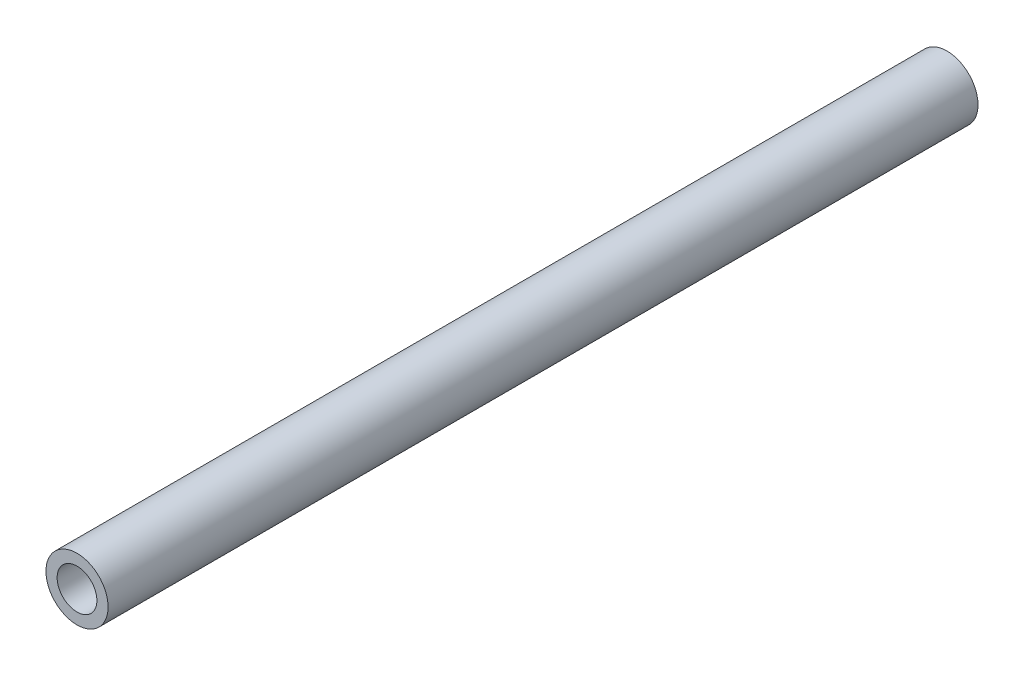
ISO-10303-21;
HEADER;
FILE_DESCRIPTION(('STEP AP214'),'2;1');
FILE_NAME('part.step','',(''),(''),'','','');
FILE_SCHEMA(('AUTOMOTIVE_DESIGN { 1 0 10303 214 1 1 1 1 }'));
ENDSEC;
DATA;
#1=APPLICATION_CONTEXT('core data for automotive mechanical design processes');
#2=APPLICATION_PROTOCOL_DEFINITION('international standard','automotive_design',2000,#1);
#3=PRODUCT_CONTEXT('',#1,'mechanical');
#4=PRODUCT('Part','Part','',(#3));
#5=PRODUCT_RELATED_PRODUCT_CATEGORY('part','',(#4));
#6=PRODUCT_DEFINITION_FORMATION('','',#4);
#7=PRODUCT_DEFINITION_CONTEXT('part definition',#1,'design');
#8=PRODUCT_DEFINITION('design','',#6,#7);
#9=PRODUCT_DEFINITION_SHAPE('','',#8);
#10=(LENGTH_UNIT() NAMED_UNIT(*) SI_UNIT(.MILLI.,.METRE.));
#11=(NAMED_UNIT(*) PLANE_ANGLE_UNIT() SI_UNIT($,.RADIAN.));
#12=(NAMED_UNIT(*) SI_UNIT($,.STERADIAN.) SOLID_ANGLE_UNIT());
#13=UNCERTAINTY_MEASURE_WITH_UNIT(LENGTH_MEASURE(1.E-05),#10,'distance_accuracy_value','');
#14=(GEOMETRIC_REPRESENTATION_CONTEXT(3) GLOBAL_UNCERTAINTY_ASSIGNED_CONTEXT((#13)) GLOBAL_UNIT_ASSIGNED_CONTEXT((#10,
#11,#12)) REPRESENTATION_CONTEXT('',''));
#15=CARTESIAN_POINT('',(0.,0.,0.));
#16=DIRECTION('',(0.,0.,1.));
#17=DIRECTION('',(1.,0.,0.));
#18=AXIS2_PLACEMENT_3D('',#15,#16,#17);
#19=CARTESIAN_POINT('',(0.,0.,70.));
#20=DIRECTION('',(0.,0.,1.));
#21=DIRECTION('',(1.,0.,0.));
#22=AXIS2_PLACEMENT_3D('',#19,#20,#21);
#23=PLANE('',#22);
#24=CARTESIAN_POINT('',(0.,0.,70.));
#25=DIRECTION('',(0.,0.,1.));
#26=DIRECTION('',(1.,0.,0.));
#27=AXIS2_PLACEMENT_3D('',#24,#25,#26);
#28=CIRCLE('',#27,2.5);
#29=CARTESIAN_POINT('',(2.5,0.,70.));
#30=VERTEX_POINT('',#29);
#31=EDGE_CURVE('E10',#30,#30,#28,.T.);
#32=ORIENTED_EDGE('',*,*,#31,.T.);
#33=EDGE_LOOP('',(#32));
#34=FACE_BOUND('',#33,.T.);
#35=CARTESIAN_POINT('',(0.,0.,70.));
#36=DIRECTION('',(0.,0.,1.));
#37=DIRECTION('',(1.,0.,0.));
#38=AXIS2_PLACEMENT_3D('',#35,#36,#37);
#39=CIRCLE('',#38,1.6);
#40=CARTESIAN_POINT('',(1.6,0.,70.));
#41=VERTEX_POINT('',#40);
#42=EDGE_CURVE('E42',#41,#41,#39,.T.);
#43=ORIENTED_EDGE('',*,*,#42,.F.);
#44=EDGE_LOOP('',(#43));
#45=FACE_BOUND('',#44,.T.);
#46=ADVANCED_FACE('F31',(#34,#45),#23,.T.);
#47=CARTESIAN_POINT('',(0.,0.,0.));
#48=DIRECTION('',(0.,0.,1.));
#49=DIRECTION('',(1.,0.,0.));
#50=AXIS2_PLACEMENT_3D('',#47,#48,#49);
#51=PLANE('',#50);
#52=CARTESIAN_POINT('',(0.,0.,0.));
#53=DIRECTION('',(0.,0.,1.));
#54=DIRECTION('',(1.,0.,0.));
#55=AXIS2_PLACEMENT_3D('',#52,#53,#54);
#56=CIRCLE('',#55,2.5);
#57=CARTESIAN_POINT('',(2.5,0.,0.));
#58=VERTEX_POINT('',#57);
#59=EDGE_CURVE('E35',#58,#58,#56,.T.);
#60=ORIENTED_EDGE('',*,*,#59,.F.);
#61=EDGE_LOOP('',(#60));
#62=FACE_BOUND('',#61,.T.);
#63=CARTESIAN_POINT('',(0.,0.,0.));
#64=DIRECTION('',(0.,0.,1.));
#65=DIRECTION('',(1.,0.,0.));
#66=AXIS2_PLACEMENT_3D('',#63,#64,#65);
#67=CIRCLE('',#66,1.6);
#68=CARTESIAN_POINT('',(1.6,0.,0.));
#69=VERTEX_POINT('',#68);
#70=EDGE_CURVE('E44',#69,#69,#67,.T.);
#71=ORIENTED_EDGE('',*,*,#70,.T.);
#72=EDGE_LOOP('',(#71));
#73=FACE_BOUND('',#72,.T.);
#74=ADVANCED_FACE('F54',(#62,#73),#51,.F.);
#75=CARTESIAN_POINT('',(0.,0.,70.));
#76=DIRECTION('',(0.,0.,-1.));
#77=DIRECTION('',(-1.,0.,0.));
#78=AXIS2_PLACEMENT_3D('',#75,#76,#77);
#79=CYLINDRICAL_SURFACE('',#78,2.5);
#80=ORIENTED_EDGE('',*,*,#31,.F.);
#81=EDGE_LOOP('',(#80));
#82=FACE_BOUND('',#81,.T.);
#83=ORIENTED_EDGE('',*,*,#59,.T.);
#84=EDGE_LOOP('',(#83));
#85=FACE_BOUND('',#84,.T.);
#86=ADVANCED_FACE('F33',(#82,#85),#79,.T.);
#87=CARTESIAN_POINT('',(0.,0.,70.));
#88=DIRECTION('',(0.,0.,-1.));
#89=DIRECTION('',(-1.,0.,0.));
#90=AXIS2_PLACEMENT_3D('',#87,#88,#89);
#91=CYLINDRICAL_SURFACE('',#90,1.6);
#92=ORIENTED_EDGE('',*,*,#42,.T.);
#93=EDGE_LOOP('',(#92));
#94=FACE_BOUND('',#93,.T.);
#95=ORIENTED_EDGE('',*,*,#70,.F.);
#96=EDGE_LOOP('',(#95));
#97=FACE_BOUND('',#96,.T.);
#98=ADVANCED_FACE('F50',(#94,#97),#91,.F.);
#99=CLOSED_SHELL('',(#46,#74,#86,#98));
#100=MANIFOLD_SOLID_BREP('B2',#99);
#101=ADVANCED_BREP_SHAPE_REPRESENTATION('',(#18,#100),#14);
#102=SHAPE_DEFINITION_REPRESENTATION(#9,#101);
ENDSEC;
END-ISO-10303-21;
